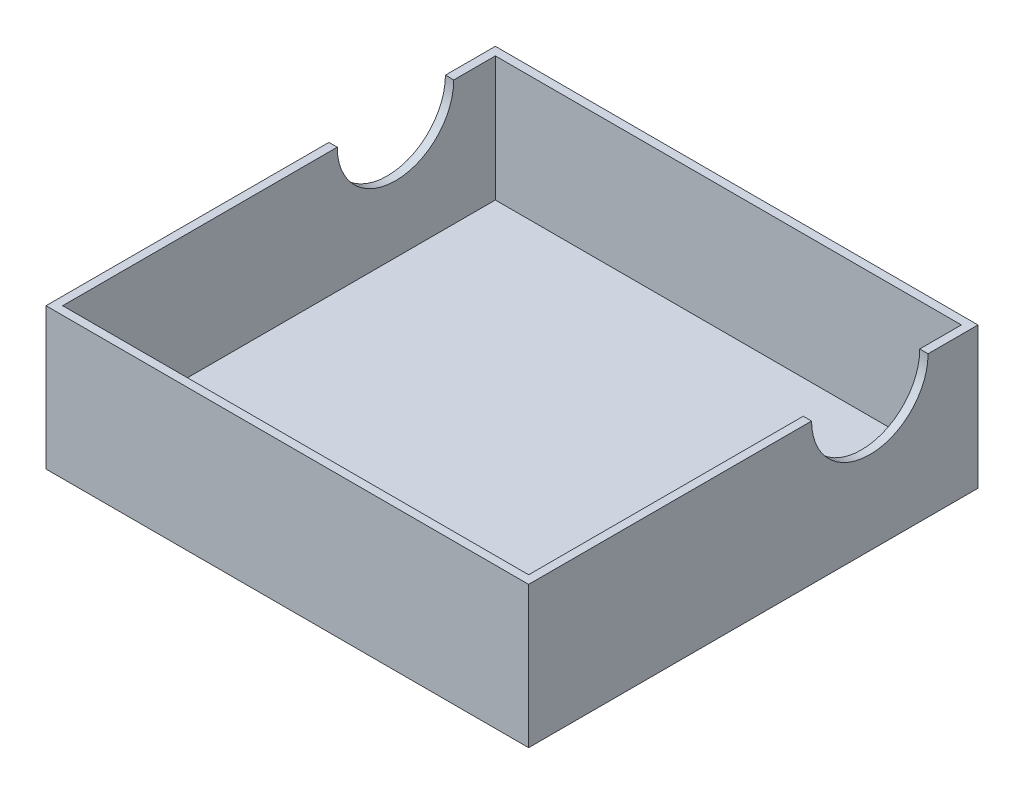
ISO-10303-21;
HEADER;
FILE_DESCRIPTION(('STEP AP214'),'2;1');
FILE_NAME('part.step','',(''),(''),'','','');
FILE_SCHEMA(('AUTOMOTIVE_DESIGN { 1 0 10303 214 1 1 1 1 }'));
ENDSEC;
DATA;
#1=APPLICATION_CONTEXT('core data for automotive mechanical design processes');
#2=APPLICATION_PROTOCOL_DEFINITION('international standard','automotive_design',2000,#1);
#3=PRODUCT_CONTEXT('',#1,'mechanical');
#4=PRODUCT('Part','Part','',(#3));
#5=PRODUCT_RELATED_PRODUCT_CATEGORY('part','',(#4));
#6=PRODUCT_DEFINITION_FORMATION('','',#4);
#7=PRODUCT_DEFINITION_CONTEXT('part definition',#1,'design');
#8=PRODUCT_DEFINITION('design','',#6,#7);
#9=PRODUCT_DEFINITION_SHAPE('','',#8);
#10=(LENGTH_UNIT() NAMED_UNIT(*) SI_UNIT(.MILLI.,.METRE.));
#11=(NAMED_UNIT(*) PLANE_ANGLE_UNIT() SI_UNIT($,.RADIAN.));
#12=(NAMED_UNIT(*) SI_UNIT($,.STERADIAN.) SOLID_ANGLE_UNIT());
#13=UNCERTAINTY_MEASURE_WITH_UNIT(LENGTH_MEASURE(1.E-05),#10,'distance_accuracy_value','');
#14=(GEOMETRIC_REPRESENTATION_CONTEXT(3) GLOBAL_UNCERTAINTY_ASSIGNED_CONTEXT((#13)) GLOBAL_UNIT_ASSIGNED_CONTEXT((#10,
#11,#12)) REPRESENTATION_CONTEXT('',''));
#15=CARTESIAN_POINT('',(0.,0.,0.));
#16=DIRECTION('',(0.,0.,1.));
#17=DIRECTION('',(1.,0.,0.));
#18=AXIS2_PLACEMENT_3D('',#15,#16,#17);
#19=CARTESIAN_POINT('',(0.,7.5,0.));
#20=DIRECTION('',(0.,1.,0.));
#21=DIRECTION('',(0.,0.,1.));
#22=AXIS2_PLACEMENT_3D('',#19,#20,#21);
#23=PLANE('',#22);
#24=DIRECTION('',(-1.,0.,0.));
#25=VECTOR('',#24,1.);
#26=CARTESIAN_POINT('',(-22.3255813953488,7.5,-9.87906976744185));
#27=LINE('',#26,#25);
#28=CARTESIAN_POINT('',(-22.3255813953488,7.5,-9.87906976744185));
#29=VERTEX_POINT('',#28);
#30=CARTESIAN_POINT('',(-22.8255813953488,7.5,-9.87906976744185));
#31=VERTEX_POINT('',#30);
#32=EDGE_CURVE('E11',#29,#31,#27,.T.);
#33=ORIENTED_EDGE('',*,*,#32,.F.);
#34=DIRECTION('',(0.,0.,1.));
#35=VECTOR('',#34,1.);
#36=CARTESIAN_POINT('',(-22.3255813953488,7.5,0.));
#37=LINE('',#36,#35);
#38=CARTESIAN_POINT('',(-22.3255813953488,7.5,-12.3790697674419));
#39=VERTEX_POINT('',#38);
#40=EDGE_CURVE('E142',#39,#29,#37,.T.);
#41=ORIENTED_EDGE('',*,*,#40,.F.);
#42=DIRECTION('',(-1.,0.,0.));
#43=VECTOR('',#42,1.);
#44=CARTESIAN_POINT('',(0.,7.5,-12.3790697674419));
#45=LINE('',#44,#43);
#46=CARTESIAN_POINT('',(5.67441860465117,7.5,-12.3790697674419));
#47=VERTEX_POINT('',#46);
#48=EDGE_CURVE('E213',#47,#39,#45,.T.);
#49=ORIENTED_EDGE('',*,*,#48,.F.);
#50=DIRECTION('',(0.,0.,-1.));
#51=VECTOR('',#50,1.);
#52=CARTESIAN_POINT('',(5.67441860465117,7.5,0.));
#53=LINE('',#52,#51);
#54=CARTESIAN_POINT('',(5.67441860465117,7.5,-9.87906976744185));
#55=VERTEX_POINT('',#54);
#56=EDGE_CURVE('E165',#55,#47,#53,.T.);
#57=ORIENTED_EDGE('',*,*,#56,.F.);
#58=DIRECTION('',(1.,0.,0.));
#59=VECTOR('',#58,1.);
#60=CARTESIAN_POINT('',(5.67441860465117,7.5,-9.87906976744185));
#61=LINE('',#60,#59);
#62=CARTESIAN_POINT('',(6.17441860465117,7.5,-9.87906976744185));
#63=VERTEX_POINT('',#62);
#64=EDGE_CURVE('E182',#63,#55,#61,.F.);
#65=ORIENTED_EDGE('',*,*,#64,.F.);
#66=DIRECTION('',(0.,0.,1.));
#67=VECTOR('',#66,1.);
#68=CARTESIAN_POINT('',(6.17441860465117,7.5,0.));
#69=LINE('',#68,#67);
#70=CARTESIAN_POINT('',(6.17441860465117,7.5,-12.8790697674419));
#71=VERTEX_POINT('',#70);
#72=EDGE_CURVE('E152',#71,#63,#69,.T.);
#73=ORIENTED_EDGE('',*,*,#72,.F.);
#74=DIRECTION('',(1.,0.,0.));
#75=VECTOR('',#74,1.);
#76=CARTESIAN_POINT('',(0.,7.5,-12.8790697674419));
#77=LINE('',#76,#75);
#78=CARTESIAN_POINT('',(-22.8255813953488,7.5,-12.8790697674419));
#79=VERTEX_POINT('',#78);
#80=EDGE_CURVE('E141',#79,#71,#77,.T.);
#81=ORIENTED_EDGE('',*,*,#80,.F.);
#82=DIRECTION('',(0.,0.,-1.));
#83=VECTOR('',#82,1.);
#84=CARTESIAN_POINT('',(-22.8255813953488,7.5,0.));
#85=LINE('',#84,#83);
#86=EDGE_CURVE('E134',#31,#79,#85,.T.);
#87=ORIENTED_EDGE('',*,*,#86,.F.);
#88=EDGE_LOOP('',(#33,#41,#49,#57,#65,#73,#81,#87));
#89=FACE_BOUND('',#88,.T.);
#90=ADVANCED_FACE('F38',(#89),#23,.T.);
#91=CARTESIAN_POINT('',(0.,0.,0.));
#92=DIRECTION('',(0.,1.,0.));
#93=DIRECTION('',(0.,0.,1.));
#94=AXIS2_PLACEMENT_3D('',#91,#92,#93);
#95=PLANE('',#94);
#96=DIRECTION('',(0.,0.,-1.));
#97=VECTOR('',#96,1.);
#98=CARTESIAN_POINT('',(5.67441860465117,0.,0.));
#99=LINE('',#98,#97);
#100=CARTESIAN_POINT('',(5.67441860465117,0.,13.6209302325581));
#101=VERTEX_POINT('',#100);
#102=CARTESIAN_POINT('',(5.67441860465117,0.,-12.3790697674419));
#103=VERTEX_POINT('',#102);
#104=EDGE_CURVE('E156',#101,#103,#99,.T.);
#105=ORIENTED_EDGE('',*,*,#104,.T.);
#106=DIRECTION('',(-1.,0.,0.));
#107=VECTOR('',#106,1.);
#108=CARTESIAN_POINT('',(0.,0.,-12.3790697674419));
#109=LINE('',#108,#107);
#110=CARTESIAN_POINT('',(-22.3255813953488,0.,-12.3790697674419));
#111=VERTEX_POINT('',#110);
#112=EDGE_CURVE('E214',#103,#111,#109,.T.);
#113=ORIENTED_EDGE('',*,*,#112,.T.);
#114=DIRECTION('',(0.,0.,1.));
#115=VECTOR('',#114,1.);
#116=CARTESIAN_POINT('',(-22.3255813953488,0.,0.));
#117=LINE('',#116,#115);
#118=CARTESIAN_POINT('',(-22.3255813953488,0.,13.6209302325581));
#119=VERTEX_POINT('',#118);
#120=EDGE_CURVE('E162',#111,#119,#117,.T.);
#121=ORIENTED_EDGE('',*,*,#120,.T.);
#122=DIRECTION('',(1.,0.,0.));
#123=VECTOR('',#122,1.);
#124=CARTESIAN_POINT('',(0.,0.,13.6209302325581));
#125=LINE('',#124,#123);
#126=EDGE_CURVE('E158',#119,#101,#125,.T.);
#127=ORIENTED_EDGE('',*,*,#126,.T.);
#128=EDGE_LOOP('',(#105,#113,#121,#127));
#129=FACE_BOUND('',#128,.T.);
#130=ADVANCED_FACE('F235',(#129),#95,.T.);
#131=CARTESIAN_POINT('',(6.17441860465117,-1.,0.));
#132=DIRECTION('',(-1.,0.,0.));
#133=DIRECTION('',(0.,0.,1.));
#134=AXIS2_PLACEMENT_3D('',#131,#132,#133);
#135=PLANE('',#134);
#136=ORIENTED_EDGE('',*,*,#72,.T.);
#137=CARTESIAN_POINT('',(6.17441860465117,7.5,-6.37906976744185));
#138=DIRECTION('',(1.,0.,0.));
#139=DIRECTION('',(0.,0.,-1.));
#140=AXIS2_PLACEMENT_3D('',#137,#138,#139);
#141=CIRCLE('',#140,3.5);
#142=CARTESIAN_POINT('',(6.17441860465117,7.5,-2.87906976744185));
#143=VERTEX_POINT('',#142);
#144=EDGE_CURVE('E60',#143,#63,#141,.T.);
#145=ORIENTED_EDGE('',*,*,#144,.F.);
#146=CARTESIAN_POINT('',(6.17441860465117,7.5,14.1209302325581));
#147=VERTEX_POINT('',#146);
#148=EDGE_CURVE('E151',#143,#147,#69,.T.);
#149=ORIENTED_EDGE('',*,*,#148,.T.);
#150=DIRECTION('',(0.,1.,0.));
#151=VECTOR('',#150,1.);
#152=CARTESIAN_POINT('',(6.17441860465117,-1.,14.1209302325581));
#153=LINE('',#152,#151);
#154=CARTESIAN_POINT('',(6.17441860465117,-1.,14.1209302325581));
#155=VERTEX_POINT('',#154);
#156=EDGE_CURVE('E179',#155,#147,#153,.T.);
#157=ORIENTED_EDGE('',*,*,#156,.F.);
#158=DIRECTION('',(0.,0.,1.));
#159=VECTOR('',#158,1.);
#160=CARTESIAN_POINT('',(6.17441860465117,-1.,0.));
#161=LINE('',#160,#159);
#162=CARTESIAN_POINT('',(6.17441860465117,-1.,-12.8790697674419));
#163=VERTEX_POINT('',#162);
#164=EDGE_CURVE('E169',#163,#155,#161,.T.);
#165=ORIENTED_EDGE('',*,*,#164,.F.);
#166=DIRECTION('',(0.,1.,0.));
#167=VECTOR('',#166,1.);
#168=CARTESIAN_POINT('',(6.17441860465117,-1.,-12.8790697674419));
#169=LINE('',#168,#167);
#170=EDGE_CURVE('E178',#163,#71,#169,.T.);
#171=ORIENTED_EDGE('',*,*,#170,.T.);
#172=EDGE_LOOP('',(#136,#145,#149,#157,#165,#171));
#173=FACE_BOUND('',#172,.T.);
#174=ADVANCED_FACE('F40',(#173),#135,.F.);
#175=CARTESIAN_POINT('',(0.,-1.,14.1209302325581));
#176=DIRECTION('',(0.,0.,-1.));
#177=DIRECTION('',(-1.,0.,0.));
#178=AXIS2_PLACEMENT_3D('',#175,#176,#177);
#179=PLANE('',#178);
#180=ORIENTED_EDGE('',*,*,#156,.T.);
#181=DIRECTION('',(-1.,0.,0.));
#182=VECTOR('',#181,1.);
#183=CARTESIAN_POINT('',(0.,7.5,14.1209302325581));
#184=LINE('',#183,#182);
#185=CARTESIAN_POINT('',(-22.8255813953488,7.5,14.1209302325581));
#186=VERTEX_POINT('',#185);
#187=EDGE_CURVE('E144',#147,#186,#184,.T.);
#188=ORIENTED_EDGE('',*,*,#187,.T.);
#189=DIRECTION('',(0.,1.,0.));
#190=VECTOR('',#189,1.);
#191=CARTESIAN_POINT('',(-22.8255813953488,-1.,14.1209302325581));
#192=LINE('',#191,#190);
#193=CARTESIAN_POINT('',(-22.8255813953488,-1.,14.1209302325581));
#194=VERTEX_POINT('',#193);
#195=EDGE_CURVE('E183',#194,#186,#192,.T.);
#196=ORIENTED_EDGE('',*,*,#195,.F.);
#197=DIRECTION('',(-1.,0.,0.));
#198=VECTOR('',#197,1.);
#199=CARTESIAN_POINT('',(0.,-1.,14.1209302325581));
#200=LINE('',#199,#198);
#201=EDGE_CURVE('E176',#155,#194,#200,.T.);
#202=ORIENTED_EDGE('',*,*,#201,.F.);
#203=EDGE_LOOP('',(#180,#188,#196,#202));
#204=FACE_BOUND('',#203,.T.);
#205=ADVANCED_FACE('F291',(#204),#179,.F.);
#206=CARTESIAN_POINT('',(-22.8255813953488,-1.,0.));
#207=DIRECTION('',(1.,0.,0.));
#208=DIRECTION('',(0.,0.,-1.));
#209=AXIS2_PLACEMENT_3D('',#206,#207,#208);
#210=PLANE('',#209);
#211=CARTESIAN_POINT('',(-22.8255813953488,7.5,-2.87906976744185));
#212=VERTEX_POINT('',#211);
#213=EDGE_CURVE('E137',#186,#212,#85,.T.);
#214=ORIENTED_EDGE('',*,*,#213,.T.);
#215=CARTESIAN_POINT('',(-22.8255813953488,7.5,-6.37906976744185));
#216=DIRECTION('',(-1.,0.,0.));
#217=DIRECTION('',(0.,0.,1.));
#218=AXIS2_PLACEMENT_3D('',#215,#216,#217);
#219=CIRCLE('',#218,3.5);
#220=EDGE_CURVE('E52',#31,#212,#219,.T.);
#221=ORIENTED_EDGE('',*,*,#220,.F.);
#222=ORIENTED_EDGE('',*,*,#86,.T.);
#223=DIRECTION('',(0.,1.,0.));
#224=VECTOR('',#223,1.);
#225=CARTESIAN_POINT('',(-22.8255813953488,-1.,-12.8790697674419));
#226=LINE('',#225,#224);
#227=CARTESIAN_POINT('',(-22.8255813953488,-1.,-12.8790697674419));
#228=VERTEX_POINT('',#227);
#229=EDGE_CURVE('E185',#228,#79,#226,.T.);
#230=ORIENTED_EDGE('',*,*,#229,.F.);
#231=DIRECTION('',(0.,0.,-1.));
#232=VECTOR('',#231,1.);
#233=CARTESIAN_POINT('',(-22.8255813953488,-1.,0.));
#234=LINE('',#233,#232);
#235=EDGE_CURVE('E174',#194,#228,#234,.T.);
#236=ORIENTED_EDGE('',*,*,#235,.F.);
#237=ORIENTED_EDGE('',*,*,#195,.T.);
#238=EDGE_LOOP('',(#214,#221,#222,#230,#236,#237));
#239=FACE_BOUND('',#238,.T.);
#240=ADVANCED_FACE('F132',(#239),#210,.F.);
#241=CARTESIAN_POINT('',(0.,-1.,-12.8790697674419));
#242=DIRECTION('',(0.,0.,1.));
#243=DIRECTION('',(1.,0.,0.));
#244=AXIS2_PLACEMENT_3D('',#241,#242,#243);
#245=PLANE('',#244);
#246=ORIENTED_EDGE('',*,*,#229,.T.);
#247=ORIENTED_EDGE('',*,*,#80,.T.);
#248=ORIENTED_EDGE('',*,*,#170,.F.);
#249=DIRECTION('',(1.,0.,0.));
#250=VECTOR('',#249,1.);
#251=CARTESIAN_POINT('',(0.,-1.,-12.8790697674419));
#252=LINE('',#251,#250);
#253=EDGE_CURVE('E172',#228,#163,#252,.T.);
#254=ORIENTED_EDGE('',*,*,#253,.F.);
#255=EDGE_LOOP('',(#246,#247,#248,#254));
#256=FACE_BOUND('',#255,.T.);
#257=ADVANCED_FACE('F290',(#256),#245,.F.);
#258=CARTESIAN_POINT('',(0.,-1.,0.));
#259=DIRECTION('',(0.,1.,0.));
#260=DIRECTION('',(0.,0.,1.));
#261=AXIS2_PLACEMENT_3D('',#258,#259,#260);
#262=PLANE('',#261);
#263=ORIENTED_EDGE('',*,*,#164,.T.);
#264=ORIENTED_EDGE('',*,*,#201,.T.);
#265=ORIENTED_EDGE('',*,*,#235,.T.);
#266=ORIENTED_EDGE('',*,*,#253,.T.);
#267=EDGE_LOOP('',(#263,#264,#265,#266));
#268=FACE_BOUND('',#267,.T.);
#269=ADVANCED_FACE('F244',(#268),#262,.F.);
#270=CARTESIAN_POINT('',(5.67441860465117,7.5,0.));
#271=DIRECTION('',(-1.,0.,0.));
#272=DIRECTION('',(0.,0.,1.));
#273=AXIS2_PLACEMENT_3D('',#270,#271,#272);
#274=PLANE('',#273);
#275=CARTESIAN_POINT('',(5.67441860465117,7.5,-6.37906976744185));
#276=DIRECTION('',(1.,0.,0.));
#277=DIRECTION('',(0.,0.,-1.));
#278=AXIS2_PLACEMENT_3D('',#275,#276,#277);
#279=CIRCLE('',#278,3.5);
#280=CARTESIAN_POINT('',(5.67441860465117,7.5,-2.87906976744185));
#281=VERTEX_POINT('',#280);
#282=EDGE_CURVE('E217',#281,#55,#279,.T.);
#283=ORIENTED_EDGE('',*,*,#282,.T.);
#284=ORIENTED_EDGE('',*,*,#56,.T.);
#285=DIRECTION('',(0.,-1.,0.));
#286=VECTOR('',#285,1.);
#287=CARTESIAN_POINT('',(5.67441860465117,7.5,-12.3790697674419));
#288=LINE('',#287,#286);
#289=EDGE_CURVE('E210',#47,#103,#288,.T.);
#290=ORIENTED_EDGE('',*,*,#289,.T.);
#291=ORIENTED_EDGE('',*,*,#104,.F.);
#292=DIRECTION('',(0.,-1.,0.));
#293=VECTOR('',#292,1.);
#294=CARTESIAN_POINT('',(5.67441860465117,7.5,13.6209302325581));
#295=LINE('',#294,#293);
#296=CARTESIAN_POINT('',(5.67441860465117,7.5,13.6209302325581));
#297=VERTEX_POINT('',#296);
#298=EDGE_CURVE('E167',#297,#101,#295,.T.);
#299=ORIENTED_EDGE('',*,*,#298,.F.);
#300=EDGE_CURVE('E203',#297,#281,#53,.T.);
#301=ORIENTED_EDGE('',*,*,#300,.T.);
#302=EDGE_LOOP('',(#283,#284,#290,#291,#299,#301));
#303=FACE_BOUND('',#302,.T.);
#304=ADVANCED_FACE('F225',(#303),#274,.T.);
#305=CARTESIAN_POINT('',(0.,7.5,13.6209302325581));
#306=DIRECTION('',(0.,0.,-1.));
#307=DIRECTION('',(-1.,0.,0.));
#308=AXIS2_PLACEMENT_3D('',#305,#306,#307);
#309=PLANE('',#308);
#310=ORIENTED_EDGE('',*,*,#126,.F.);
#311=DIRECTION('',(0.,-1.,0.));
#312=VECTOR('',#311,1.);
#313=CARTESIAN_POINT('',(-22.3255813953488,7.5,13.6209302325581));
#314=LINE('',#313,#312);
#315=CARTESIAN_POINT('',(-22.3255813953488,7.5,13.6209302325581));
#316=VERTEX_POINT('',#315);
#317=EDGE_CURVE('E155',#316,#119,#314,.T.);
#318=ORIENTED_EDGE('',*,*,#317,.F.);
#319=DIRECTION('',(1.,0.,0.));
#320=VECTOR('',#319,1.);
#321=CARTESIAN_POINT('',(0.,7.5,13.6209302325581));
#322=LINE('',#321,#320);
#323=EDGE_CURVE('E202',#316,#297,#322,.T.);
#324=ORIENTED_EDGE('',*,*,#323,.T.);
#325=ORIENTED_EDGE('',*,*,#298,.T.);
#326=EDGE_LOOP('',(#310,#318,#324,#325));
#327=FACE_BOUND('',#326,.T.);
#328=ADVANCED_FACE('F236',(#327),#309,.T.);
#329=CARTESIAN_POINT('',(-22.3255813953488,7.5,0.));
#330=DIRECTION('',(1.,0.,0.));
#331=DIRECTION('',(0.,0.,-1.));
#332=AXIS2_PLACEMENT_3D('',#329,#330,#331);
#333=PLANE('',#332);
#334=CARTESIAN_POINT('',(-22.3255813953488,7.5,-6.37906976744185));
#335=DIRECTION('',(-1.,0.,0.));
#336=DIRECTION('',(0.,0.,1.));
#337=AXIS2_PLACEMENT_3D('',#334,#335,#336);
#338=CIRCLE('',#337,3.5);
#339=CARTESIAN_POINT('',(-22.3255813953488,7.5,-2.87906976744185));
#340=VERTEX_POINT('',#339);
#341=EDGE_CURVE('E126',#29,#340,#338,.T.);
#342=ORIENTED_EDGE('',*,*,#341,.T.);
#343=EDGE_CURVE('E145',#340,#316,#37,.T.);
#344=ORIENTED_EDGE('',*,*,#343,.T.);
#345=ORIENTED_EDGE('',*,*,#317,.T.);
#346=ORIENTED_EDGE('',*,*,#120,.F.);
#347=DIRECTION('',(0.,-1.,0.));
#348=VECTOR('',#347,1.);
#349=CARTESIAN_POINT('',(-22.3255813953488,7.5,-12.3790697674419));
#350=LINE('',#349,#348);
#351=EDGE_CURVE('E159',#39,#111,#350,.T.);
#352=ORIENTED_EDGE('',*,*,#351,.F.);
#353=ORIENTED_EDGE('',*,*,#40,.T.);
#354=EDGE_LOOP('',(#342,#344,#345,#346,#352,#353));
#355=FACE_BOUND('',#354,.T.);
#356=ADVANCED_FACE('F194',(#355),#333,.T.);
#357=DIRECTION('',(-1.,0.,0.));
#358=VECTOR('',#357,1.);
#359=CARTESIAN_POINT('',(-22.3255813953488,7.5,-2.87906976744185));
#360=LINE('',#359,#358);
#361=EDGE_CURVE('E46',#212,#340,#360,.F.);
#362=ORIENTED_EDGE('',*,*,#361,.F.);
#363=ORIENTED_EDGE('',*,*,#213,.F.);
#364=ORIENTED_EDGE('',*,*,#187,.F.);
#365=ORIENTED_EDGE('',*,*,#148,.F.);
#366=DIRECTION('',(1.,0.,0.));
#367=VECTOR('',#366,1.);
#368=CARTESIAN_POINT('',(5.67441860465117,7.5,-2.87906976744185));
#369=LINE('',#368,#367);
#370=EDGE_CURVE('E190',#281,#143,#369,.T.);
#371=ORIENTED_EDGE('',*,*,#370,.F.);
#372=ORIENTED_EDGE('',*,*,#300,.F.);
#373=ORIENTED_EDGE('',*,*,#323,.F.);
#374=ORIENTED_EDGE('',*,*,#343,.F.);
#375=EDGE_LOOP('',(#362,#363,#364,#365,#371,#372,#373,#374));
#376=FACE_BOUND('',#375,.T.);
#377=ADVANCED_FACE('F199',(#376),#23,.T.);
#378=CARTESIAN_POINT('',(0.,7.5,-12.3790697674419));
#379=DIRECTION('',(0.,0.,1.));
#380=DIRECTION('',(1.,0.,0.));
#381=AXIS2_PLACEMENT_3D('',#378,#379,#380);
#382=PLANE('',#381);
#383=ORIENTED_EDGE('',*,*,#112,.F.);
#384=ORIENTED_EDGE('',*,*,#289,.F.);
#385=ORIENTED_EDGE('',*,*,#48,.T.);
#386=ORIENTED_EDGE('',*,*,#351,.T.);
#387=EDGE_LOOP('',(#383,#384,#385,#386));
#388=FACE_BOUND('',#387,.T.);
#389=ADVANCED_FACE('F231',(#388),#382,.T.);
#390=CARTESIAN_POINT('',(5.67441860465117,7.5,-6.37906976744185));
#391=DIRECTION('',(1.,0.,0.));
#392=DIRECTION('',(0.,0.,-1.));
#393=AXIS2_PLACEMENT_3D('',#390,#391,#392);
#394=CYLINDRICAL_SURFACE('',#393,3.5);
#395=ORIENTED_EDGE('',*,*,#370,.T.);
#396=ORIENTED_EDGE('',*,*,#144,.T.);
#397=ORIENTED_EDGE('',*,*,#64,.T.);
#398=ORIENTED_EDGE('',*,*,#282,.F.);
#399=EDGE_LOOP('',(#395,#396,#397,#398));
#400=FACE_BOUND('',#399,.T.);
#401=ADVANCED_FACE('F257',(#400),#394,.F.);
#402=CARTESIAN_POINT('',(-22.3255813953488,7.5,-6.37906976744185));
#403=DIRECTION('',(-1.,0.,0.));
#404=DIRECTION('',(0.,0.,1.));
#405=AXIS2_PLACEMENT_3D('',#402,#403,#404);
#406=CYLINDRICAL_SURFACE('',#405,3.5);
#407=ORIENTED_EDGE('',*,*,#32,.T.);
#408=ORIENTED_EDGE('',*,*,#220,.T.);
#409=ORIENTED_EDGE('',*,*,#361,.T.);
#410=ORIENTED_EDGE('',*,*,#341,.F.);
#411=EDGE_LOOP('',(#407,#408,#409,#410));
#412=FACE_BOUND('',#411,.T.);
#413=ADVANCED_FACE('F124',(#412),#406,.F.);
#414=CLOSED_SHELL('',(#90,#130,#174,#205,#240,#257,#269,#304,#328,#356,#377,#389,#401,#413));
#415=MANIFOLD_SOLID_BREP('B2',#414);
#416=ADVANCED_BREP_SHAPE_REPRESENTATION('',(#18,#415),#14);
#417=SHAPE_DEFINITION_REPRESENTATION(#9,#416);
ENDSEC;
END-ISO-10303-21;
